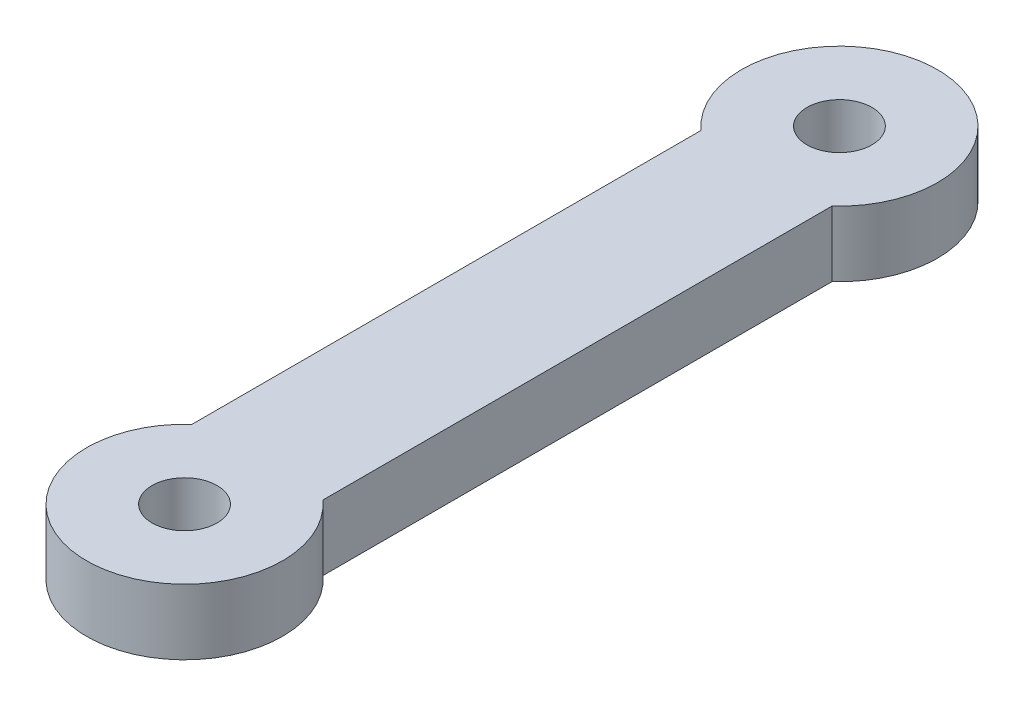
ISO-10303-21;
HEADER;
FILE_DESCRIPTION(('STEP AP214'),'2;1');
FILE_NAME('part.step','',(''),(''),'','','');
FILE_SCHEMA(('AUTOMOTIVE_DESIGN { 1 0 10303 214 1 1 1 1 }'));
ENDSEC;
DATA;
#1=APPLICATION_CONTEXT('core data for automotive mechanical design processes');
#2=APPLICATION_PROTOCOL_DEFINITION('international standard','automotive_design',2000,#1);
#3=PRODUCT_CONTEXT('',#1,'mechanical');
#4=PRODUCT('Part','Part','',(#3));
#5=PRODUCT_RELATED_PRODUCT_CATEGORY('part','',(#4));
#6=PRODUCT_DEFINITION_FORMATION('','',#4);
#7=PRODUCT_DEFINITION_CONTEXT('part definition',#1,'design');
#8=PRODUCT_DEFINITION('design','',#6,#7);
#9=PRODUCT_DEFINITION_SHAPE('','',#8);
#10=(LENGTH_UNIT() NAMED_UNIT(*) SI_UNIT(.MILLI.,.METRE.));
#11=(NAMED_UNIT(*) PLANE_ANGLE_UNIT() SI_UNIT($,.RADIAN.));
#12=(NAMED_UNIT(*) SI_UNIT($,.STERADIAN.) SOLID_ANGLE_UNIT());
#13=UNCERTAINTY_MEASURE_WITH_UNIT(LENGTH_MEASURE(1.E-05),#10,'distance_accuracy_value','');
#14=(GEOMETRIC_REPRESENTATION_CONTEXT(3) GLOBAL_UNCERTAINTY_ASSIGNED_CONTEXT((#13)) GLOBAL_UNIT_ASSIGNED_CONTEXT((#10,
#11,#12)) REPRESENTATION_CONTEXT('',''));
#15=CARTESIAN_POINT('',(0.,0.,0.));
#16=DIRECTION('',(0.,0.,1.));
#17=DIRECTION('',(1.,0.,0.));
#18=AXIS2_PLACEMENT_3D('',#15,#16,#17);
#19=CARTESIAN_POINT('',(0.,3.175,31.75));
#20=DIRECTION('',(0.,-1.,0.));
#21=DIRECTION('',(0.,0.,-1.));
#22=AXIS2_PLACEMENT_3D('',#19,#20,#21);
#23=CYLINDRICAL_SURFACE('',#22,4.75);
#24=CARTESIAN_POINT('',(0.,0.,31.75));
#25=DIRECTION('',(0.,1.,0.));
#26=DIRECTION('',(0.,0.,1.));
#27=AXIS2_PLACEMENT_3D('',#24,#25,#26);
#28=CIRCLE('',#27,4.75);
#29=CARTESIAN_POINT('',(-3.175,0.,28.2170302860058));
#30=VERTEX_POINT('',#29);
#31=CARTESIAN_POINT('',(3.175,0.,28.2170302860058));
#32=VERTEX_POINT('',#31);
#33=EDGE_CURVE('E108',#30,#32,#28,.T.);
#34=ORIENTED_EDGE('',*,*,#33,.T.);
#35=DIRECTION('',(0.,-1.,0.));
#36=VECTOR('',#35,1.);
#37=CARTESIAN_POINT('',(3.175,3.175,28.2170302860058));
#38=LINE('',#37,#36);
#39=CARTESIAN_POINT('',(3.175,3.175,28.2170302860058));
#40=VERTEX_POINT('',#39);
#41=EDGE_CURVE('E11',#40,#32,#38,.T.);
#42=ORIENTED_EDGE('',*,*,#41,.F.);
#43=CARTESIAN_POINT('',(0.,3.175,31.75));
#44=DIRECTION('',(0.,1.,0.));
#45=DIRECTION('',(0.,0.,1.));
#46=AXIS2_PLACEMENT_3D('',#43,#44,#45);
#47=CIRCLE('',#46,4.75);
#48=CARTESIAN_POINT('',(-3.175,3.175,28.2170302860058));
#49=VERTEX_POINT('',#48);
#50=EDGE_CURVE('E78',#49,#40,#47,.T.);
#51=ORIENTED_EDGE('',*,*,#50,.F.);
#52=DIRECTION('',(0.,-1.,0.));
#53=VECTOR('',#52,1.);
#54=CARTESIAN_POINT('',(-3.175,3.175,28.2170302860058));
#55=LINE('',#54,#53);
#56=EDGE_CURVE('E104',#49,#30,#55,.T.);
#57=ORIENTED_EDGE('',*,*,#56,.T.);
#58=EDGE_LOOP('',(#34,#42,#51,#57));
#59=FACE_BOUND('',#58,.T.);
#60=ADVANCED_FACE('F35',(#59),#23,.T.);
#61=CARTESIAN_POINT('',(3.175,3.175,0.));
#62=DIRECTION('',(1.,0.,0.));
#63=DIRECTION('',(0.,0.,-1.));
#64=AXIS2_PLACEMENT_3D('',#61,#62,#63);
#65=PLANE('',#64);
#66=DIRECTION('',(0.,0.,1.));
#67=VECTOR('',#66,1.);
#68=CARTESIAN_POINT('',(3.175,0.,0.));
#69=LINE('',#68,#67);
#70=CARTESIAN_POINT('',(3.175,0.,3.53296971399416));
#71=VERTEX_POINT('',#70);
#72=EDGE_CURVE('E88',#71,#32,#69,.T.);
#73=ORIENTED_EDGE('',*,*,#72,.F.);
#74=DIRECTION('',(0.,-1.,0.));
#75=VECTOR('',#74,1.);
#76=CARTESIAN_POINT('',(3.175,3.175,3.53296971399416));
#77=LINE('',#76,#75);
#78=CARTESIAN_POINT('',(3.175,3.175,3.53296971399416));
#79=VERTEX_POINT('',#78);
#80=EDGE_CURVE('E44',#79,#71,#77,.T.);
#81=ORIENTED_EDGE('',*,*,#80,.F.);
#82=DIRECTION('',(0.,0.,1.));
#83=VECTOR('',#82,1.);
#84=CARTESIAN_POINT('',(3.175,3.175,0.));
#85=LINE('',#84,#83);
#86=EDGE_CURVE('E86',#79,#40,#85,.T.);
#87=ORIENTED_EDGE('',*,*,#86,.T.);
#88=ORIENTED_EDGE('',*,*,#41,.T.);
#89=EDGE_LOOP('',(#73,#81,#87,#88));
#90=FACE_BOUND('',#89,.T.);
#91=ADVANCED_FACE('F85',(#90),#65,.T.);
#92=CARTESIAN_POINT('',(0.,3.175,0.));
#93=DIRECTION('',(0.,-1.,0.));
#94=DIRECTION('',(0.,0.,-1.));
#95=AXIS2_PLACEMENT_3D('',#92,#93,#94);
#96=CYLINDRICAL_SURFACE('',#95,4.75);
#97=CARTESIAN_POINT('',(0.,0.,0.));
#98=DIRECTION('',(0.,1.,0.));
#99=DIRECTION('',(0.,0.,1.));
#100=AXIS2_PLACEMENT_3D('',#97,#98,#99);
#101=CIRCLE('',#100,4.75);
#102=CARTESIAN_POINT('',(-3.175,0.,3.53296971399416));
#103=VERTEX_POINT('',#102);
#104=EDGE_CURVE('E67',#71,#103,#101,.T.);
#105=ORIENTED_EDGE('',*,*,#104,.T.);
#106=DIRECTION('',(0.,-1.,0.));
#107=VECTOR('',#106,1.);
#108=CARTESIAN_POINT('',(-3.175,3.175,3.53296971399416));
#109=LINE('',#108,#107);
#110=CARTESIAN_POINT('',(-3.175,3.175,3.53296971399416));
#111=VERTEX_POINT('',#110);
#112=EDGE_CURVE('E89',#111,#103,#109,.T.);
#113=ORIENTED_EDGE('',*,*,#112,.F.);
#114=CARTESIAN_POINT('',(0.,3.175,0.));
#115=DIRECTION('',(0.,1.,0.));
#116=DIRECTION('',(0.,0.,1.));
#117=AXIS2_PLACEMENT_3D('',#114,#115,#116);
#118=CIRCLE('',#117,4.75);
#119=EDGE_CURVE('E90',#79,#111,#118,.T.);
#120=ORIENTED_EDGE('',*,*,#119,.F.);
#121=ORIENTED_EDGE('',*,*,#80,.T.);
#122=EDGE_LOOP('',(#105,#113,#120,#121));
#123=FACE_BOUND('',#122,.T.);
#124=ADVANCED_FACE('F91',(#123),#96,.T.);
#125=CARTESIAN_POINT('',(-3.175,3.175,0.));
#126=DIRECTION('',(1.,0.,0.));
#127=DIRECTION('',(0.,0.,-1.));
#128=AXIS2_PLACEMENT_3D('',#125,#126,#127);
#129=PLANE('',#128);
#130=DIRECTION('',(0.,0.,1.));
#131=VECTOR('',#130,1.);
#132=CARTESIAN_POINT('',(-3.175,0.,0.));
#133=LINE('',#132,#131);
#134=EDGE_CURVE('E73',#103,#30,#133,.T.);
#135=ORIENTED_EDGE('',*,*,#134,.T.);
#136=ORIENTED_EDGE('',*,*,#56,.F.);
#137=DIRECTION('',(0.,0.,1.));
#138=VECTOR('',#137,1.);
#139=CARTESIAN_POINT('',(-3.175,3.175,0.));
#140=LINE('',#139,#138);
#141=EDGE_CURVE('E52',#111,#49,#140,.T.);
#142=ORIENTED_EDGE('',*,*,#141,.F.);
#143=ORIENTED_EDGE('',*,*,#112,.T.);
#144=EDGE_LOOP('',(#135,#136,#142,#143));
#145=FACE_BOUND('',#144,.T.);
#146=ADVANCED_FACE('F118',(#145),#129,.F.);
#147=CARTESIAN_POINT('',(0.,3.175,31.75));
#148=DIRECTION('',(0.,-1.,0.));
#149=DIRECTION('',(0.,0.,-1.));
#150=AXIS2_PLACEMENT_3D('',#147,#148,#149);
#151=CYLINDRICAL_SURFACE('',#150,1.575);
#152=CARTESIAN_POINT('',(0.,3.175,31.75));
#153=DIRECTION('',(0.,1.,0.));
#154=DIRECTION('',(0.,0.,1.));
#155=AXIS2_PLACEMENT_3D('',#152,#153,#154);
#156=CIRCLE('',#155,1.575);
#157=CARTESIAN_POINT('',(0.,3.175,33.325));
#158=VERTEX_POINT('',#157);
#159=EDGE_CURVE('E96',#158,#158,#156,.T.);
#160=ORIENTED_EDGE('',*,*,#159,.T.);
#161=EDGE_LOOP('',(#160));
#162=FACE_BOUND('',#161,.T.);
#163=CARTESIAN_POINT('',(0.,0.,31.75));
#164=DIRECTION('',(0.,1.,0.));
#165=DIRECTION('',(0.,0.,1.));
#166=AXIS2_PLACEMENT_3D('',#163,#164,#165);
#167=CIRCLE('',#166,1.575);
#168=CARTESIAN_POINT('',(0.,0.,33.325));
#169=VERTEX_POINT('',#168);
#170=EDGE_CURVE('E105',#169,#169,#167,.T.);
#171=ORIENTED_EDGE('',*,*,#170,.F.);
#172=EDGE_LOOP('',(#171));
#173=FACE_BOUND('',#172,.T.);
#174=ADVANCED_FACE('F37',(#162,#173),#151,.F.);
#175=CARTESIAN_POINT('',(0.,3.175,0.));
#176=DIRECTION('',(0.,-1.,0.));
#177=DIRECTION('',(0.,0.,-1.));
#178=AXIS2_PLACEMENT_3D('',#175,#176,#177);
#179=CYLINDRICAL_SURFACE('',#178,1.575);
#180=CARTESIAN_POINT('',(0.,3.175,0.));
#181=DIRECTION('',(0.,1.,0.));
#182=DIRECTION('',(0.,0.,1.));
#183=AXIS2_PLACEMENT_3D('',#180,#181,#182);
#184=CIRCLE('',#183,1.575);
#185=CARTESIAN_POINT('',(0.,3.175,1.575));
#186=VERTEX_POINT('',#185);
#187=EDGE_CURVE('E101',#186,#186,#184,.T.);
#188=ORIENTED_EDGE('',*,*,#187,.T.);
#189=EDGE_LOOP('',(#188));
#190=FACE_BOUND('',#189,.T.);
#191=CARTESIAN_POINT('',(0.,0.,0.));
#192=DIRECTION('',(0.,1.,0.));
#193=DIRECTION('',(0.,0.,1.));
#194=AXIS2_PLACEMENT_3D('',#191,#192,#193);
#195=CIRCLE('',#194,1.575);
#196=CARTESIAN_POINT('',(0.,0.,1.575));
#197=VERTEX_POINT('',#196);
#198=EDGE_CURVE('E114',#197,#197,#195,.T.);
#199=ORIENTED_EDGE('',*,*,#198,.F.);
#200=EDGE_LOOP('',(#199));
#201=FACE_BOUND('',#200,.T.);
#202=ADVANCED_FACE('F134',(#190,#201),#179,.F.);
#203=CARTESIAN_POINT('',(0.,3.175,0.));
#204=DIRECTION('',(0.,1.,0.));
#205=DIRECTION('',(0.,0.,1.));
#206=AXIS2_PLACEMENT_3D('',#203,#204,#205);
#207=PLANE('',#206);
#208=ORIENTED_EDGE('',*,*,#159,.F.);
#209=EDGE_LOOP('',(#208));
#210=FACE_BOUND('',#209,.T.);
#211=ORIENTED_EDGE('',*,*,#50,.T.);
#212=ORIENTED_EDGE('',*,*,#86,.F.);
#213=ORIENTED_EDGE('',*,*,#119,.T.);
#214=ORIENTED_EDGE('',*,*,#141,.T.);
#215=EDGE_LOOP('',(#211,#212,#213,#214));
#216=FACE_BOUND('',#215,.T.);
#217=ORIENTED_EDGE('',*,*,#187,.F.);
#218=EDGE_LOOP('',(#217));
#219=FACE_BOUND('',#218,.T.);
#220=ADVANCED_FACE('F93',(#210,#216,#219),#207,.T.);
#221=CARTESIAN_POINT('',(0.,0.,0.));
#222=DIRECTION('',(0.,1.,0.));
#223=DIRECTION('',(0.,0.,1.));
#224=AXIS2_PLACEMENT_3D('',#221,#222,#223);
#225=PLANE('',#224);
#226=ORIENTED_EDGE('',*,*,#170,.T.);
#227=EDGE_LOOP('',(#226));
#228=FACE_BOUND('',#227,.T.);
#229=ORIENTED_EDGE('',*,*,#33,.F.);
#230=ORIENTED_EDGE('',*,*,#134,.F.);
#231=ORIENTED_EDGE('',*,*,#104,.F.);
#232=ORIENTED_EDGE('',*,*,#72,.T.);
#233=EDGE_LOOP('',(#229,#230,#231,#232));
#234=FACE_BOUND('',#233,.T.);
#235=ORIENTED_EDGE('',*,*,#198,.T.);
#236=EDGE_LOOP('',(#235));
#237=FACE_BOUND('',#236,.T.);
#238=ADVANCED_FACE('F121',(#228,#234,#237),#225,.F.);
#239=CLOSED_SHELL('',(#60,#91,#124,#146,#174,#202,#220,#238));
#240=MANIFOLD_SOLID_BREP('B2',#239);
#241=ADVANCED_BREP_SHAPE_REPRESENTATION('',(#18,#240),#14);
#242=SHAPE_DEFINITION_REPRESENTATION(#9,#241);
ENDSEC;
END-ISO-10303-21;
